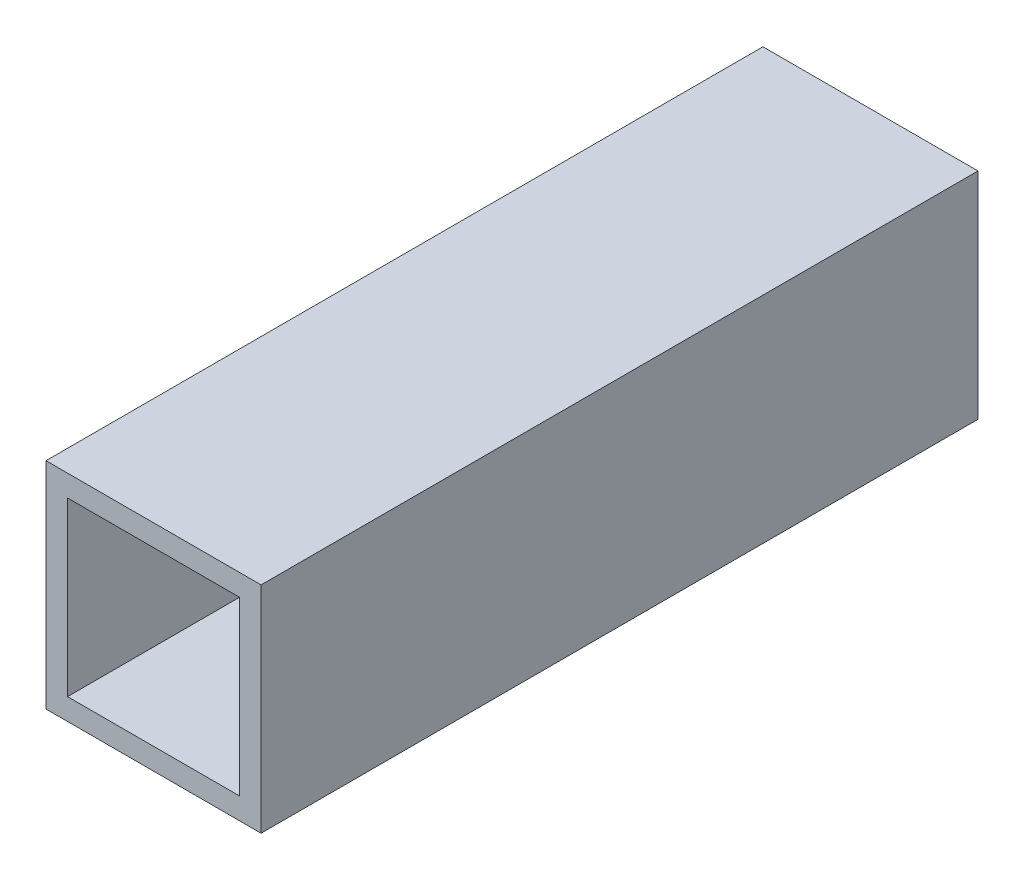
ISO-10303-21;
HEADER;
FILE_DESCRIPTION(('STEP AP214'),'2;1');
FILE_NAME('part.step','',(''),(''),'','','');
FILE_SCHEMA(('AUTOMOTIVE_DESIGN { 1 0 10303 214 1 1 1 1 }'));
ENDSEC;
DATA;
#1=APPLICATION_CONTEXT('core data for automotive mechanical design processes');
#2=APPLICATION_PROTOCOL_DEFINITION('international standard','automotive_design',2000,#1);
#3=PRODUCT_CONTEXT('',#1,'mechanical');
#4=PRODUCT('Part','Part','',(#3));
#5=PRODUCT_RELATED_PRODUCT_CATEGORY('part','',(#4));
#6=PRODUCT_DEFINITION_FORMATION('','',#4);
#7=PRODUCT_DEFINITION_CONTEXT('part definition',#1,'design');
#8=PRODUCT_DEFINITION('design','',#6,#7);
#9=PRODUCT_DEFINITION_SHAPE('','',#8);
#10=(LENGTH_UNIT() NAMED_UNIT(*) SI_UNIT(.MILLI.,.METRE.));
#11=(NAMED_UNIT(*) PLANE_ANGLE_UNIT() SI_UNIT($,.RADIAN.));
#12=(NAMED_UNIT(*) SI_UNIT($,.STERADIAN.) SOLID_ANGLE_UNIT());
#13=UNCERTAINTY_MEASURE_WITH_UNIT(LENGTH_MEASURE(1.E-05),#10,'distance_accuracy_value','');
#14=(GEOMETRIC_REPRESENTATION_CONTEXT(3) GLOBAL_UNCERTAINTY_ASSIGNED_CONTEXT((#13)) GLOBAL_UNIT_ASSIGNED_CONTEXT((#10,
#11,#12)) REPRESENTATION_CONTEXT('',''));
#15=CARTESIAN_POINT('',(0.,0.,0.));
#16=DIRECTION('',(0.,0.,1.));
#17=DIRECTION('',(1.,0.,0.));
#18=AXIS2_PLACEMENT_3D('',#15,#16,#17);
#19=CARTESIAN_POINT('',(0.,0.,50.));
#20=DIRECTION('',(0.,0.,1.));
#21=DIRECTION('',(1.,0.,0.));
#22=AXIS2_PLACEMENT_3D('',#19,#20,#21);
#23=PLANE('',#22);
#24=DIRECTION('',(0.,-1.,0.));
#25=VECTOR('',#24,1.);
#26=CARTESIAN_POINT('',(-7.01008414074451,7.73262608579252,50.));
#27=LINE('',#26,#25);
#28=CARTESIAN_POINT('',(-7.01008414074451,7.73262608579252,50.));
#29=VERTEX_POINT('',#28);
#30=CARTESIAN_POINT('',(-7.01008414074451,-7.26737391420748,50.));
#31=VERTEX_POINT('',#30);
#32=EDGE_CURVE('E134',#29,#31,#27,.T.);
#33=ORIENTED_EDGE('',*,*,#32,.T.);
#34=DIRECTION('',(1.,0.,0.));
#35=VECTOR('',#34,1.);
#36=CARTESIAN_POINT('',(-7.01008414074451,-7.26737391420748,50.));
#37=LINE('',#36,#35);
#38=CARTESIAN_POINT('',(7.98991585925548,-7.26737391420748,50.));
#39=VERTEX_POINT('',#38);
#40=EDGE_CURVE('E137',#31,#39,#37,.T.);
#41=ORIENTED_EDGE('',*,*,#40,.T.);
#42=DIRECTION('',(0.,1.,0.));
#43=VECTOR('',#42,1.);
#44=CARTESIAN_POINT('',(7.98991585925549,7.73262608579252,50.));
#45=LINE('',#44,#43);
#46=CARTESIAN_POINT('',(7.98991585925549,7.73262608579252,50.));
#47=VERTEX_POINT('',#46);
#48=EDGE_CURVE('E140',#39,#47,#45,.T.);
#49=ORIENTED_EDGE('',*,*,#48,.T.);
#50=DIRECTION('',(-1.,0.,0.));
#51=VECTOR('',#50,1.);
#52=CARTESIAN_POINT('',(-7.01008414074451,7.73262608579252,50.));
#53=LINE('',#52,#51);
#54=EDGE_CURVE('E142',#47,#29,#53,.T.);
#55=ORIENTED_EDGE('',*,*,#54,.T.);
#56=EDGE_LOOP('',(#33,#41,#49,#55));
#57=FACE_BOUND('',#56,.T.);
#58=DIRECTION('',(1.,0.,0.));
#59=VECTOR('',#58,1.);
#60=CARTESIAN_POINT('',(-5.51008414074451,-5.76737391420748,50.));
#61=LINE('',#60,#59);
#62=CARTESIAN_POINT('',(-5.51008414074451,-5.76737391420748,50.));
#63=VERTEX_POINT('',#62);
#64=CARTESIAN_POINT('',(6.48991585925549,-5.76737391420748,50.));
#65=VERTEX_POINT('',#64);
#66=EDGE_CURVE('E106',#63,#65,#61,.T.);
#67=ORIENTED_EDGE('',*,*,#66,.F.);
#68=DIRECTION('',(0.,-1.,0.));
#69=VECTOR('',#68,1.);
#70=CARTESIAN_POINT('',(-5.51008414074451,6.23262608579252,50.));
#71=LINE('',#70,#69);
#72=CARTESIAN_POINT('',(-5.51008414074451,6.23262608579252,50.));
#73=VERTEX_POINT('',#72);
#74=EDGE_CURVE('E98',#73,#63,#71,.T.);
#75=ORIENTED_EDGE('',*,*,#74,.F.);
#76=DIRECTION('',(-1.,0.,0.));
#77=VECTOR('',#76,1.);
#78=CARTESIAN_POINT('',(-5.51008414074451,6.23262608579252,50.));
#79=LINE('',#78,#77);
#80=CARTESIAN_POINT('',(6.48991585925549,6.23262608579252,50.));
#81=VERTEX_POINT('',#80);
#82=EDGE_CURVE('E120',#81,#73,#79,.T.);
#83=ORIENTED_EDGE('',*,*,#82,.F.);
#84=DIRECTION('',(0.,1.,0.));
#85=VECTOR('',#84,1.);
#86=CARTESIAN_POINT('',(6.48991585925549,6.23262608579252,50.));
#87=LINE('',#86,#85);
#88=EDGE_CURVE('E118',#65,#81,#87,.T.);
#89=ORIENTED_EDGE('',*,*,#88,.F.);
#90=EDGE_LOOP('',(#67,#75,#83,#89));
#91=FACE_BOUND('',#90,.T.);
#92=ADVANCED_FACE('F33',(#57,#91),#23,.T.);
#93=CARTESIAN_POINT('',(0.,0.,0.));
#94=DIRECTION('',(0.,0.,1.));
#95=DIRECTION('',(1.,0.,0.));
#96=AXIS2_PLACEMENT_3D('',#93,#94,#95);
#97=PLANE('',#96);
#98=DIRECTION('',(0.,-1.,0.));
#99=VECTOR('',#98,1.);
#100=CARTESIAN_POINT('',(-7.01008414074451,7.73262608579252,0.));
#101=LINE('',#100,#99);
#102=CARTESIAN_POINT('',(-7.01008414074451,7.73262608579252,0.));
#103=VERTEX_POINT('',#102);
#104=CARTESIAN_POINT('',(-7.01008414074451,-7.26737391420748,0.));
#105=VERTEX_POINT('',#104);
#106=EDGE_CURVE('E114',#103,#105,#101,.T.);
#107=ORIENTED_EDGE('',*,*,#106,.F.);
#108=DIRECTION('',(-1.,0.,0.));
#109=VECTOR('',#108,1.);
#110=CARTESIAN_POINT('',(-7.01008414074451,7.73262608579252,0.));
#111=LINE('',#110,#109);
#112=CARTESIAN_POINT('',(7.98991585925549,7.73262608579252,0.));
#113=VERTEX_POINT('',#112);
#114=EDGE_CURVE('E138',#113,#103,#111,.T.);
#115=ORIENTED_EDGE('',*,*,#114,.F.);
#116=DIRECTION('',(0.,1.,0.));
#117=VECTOR('',#116,1.);
#118=CARTESIAN_POINT('',(7.98991585925549,7.73262608579252,0.));
#119=LINE('',#118,#117);
#120=CARTESIAN_POINT('',(7.98991585925548,-7.26737391420748,0.));
#121=VERTEX_POINT('',#120);
#122=EDGE_CURVE('E149',#121,#113,#119,.T.);
#123=ORIENTED_EDGE('',*,*,#122,.F.);
#124=DIRECTION('',(1.,0.,0.));
#125=VECTOR('',#124,1.);
#126=CARTESIAN_POINT('',(-7.01008414074451,-7.26737391420748,0.));
#127=LINE('',#126,#125);
#128=EDGE_CURVE('E147',#105,#121,#127,.T.);
#129=ORIENTED_EDGE('',*,*,#128,.F.);
#130=EDGE_LOOP('',(#107,#115,#123,#129));
#131=FACE_BOUND('',#130,.T.);
#132=DIRECTION('',(0.,-1.,0.));
#133=VECTOR('',#132,1.);
#134=CARTESIAN_POINT('',(-5.51008414074451,6.23262608579252,0.));
#135=LINE('',#134,#133);
#136=CARTESIAN_POINT('',(-5.51008414074451,6.23262608579252,0.));
#137=VERTEX_POINT('',#136);
#138=CARTESIAN_POINT('',(-5.51008414074451,-5.76737391420748,0.));
#139=VERTEX_POINT('',#138);
#140=EDGE_CURVE('E56',#137,#139,#135,.T.);
#141=ORIENTED_EDGE('',*,*,#140,.T.);
#142=DIRECTION('',(1.,0.,0.));
#143=VECTOR('',#142,1.);
#144=CARTESIAN_POINT('',(-5.51008414074451,-5.76737391420748,0.));
#145=LINE('',#144,#143);
#146=CARTESIAN_POINT('',(6.48991585925549,-5.76737391420748,0.));
#147=VERTEX_POINT('',#146);
#148=EDGE_CURVE('E113',#139,#147,#145,.T.);
#149=ORIENTED_EDGE('',*,*,#148,.T.);
#150=DIRECTION('',(0.,1.,0.));
#151=VECTOR('',#150,1.);
#152=CARTESIAN_POINT('',(6.48991585925549,6.23262608579252,0.));
#153=LINE('',#152,#151);
#154=CARTESIAN_POINT('',(6.48991585925549,6.23262608579252,0.));
#155=VERTEX_POINT('',#154);
#156=EDGE_CURVE('E126',#147,#155,#153,.T.);
#157=ORIENTED_EDGE('',*,*,#156,.T.);
#158=DIRECTION('',(-1.,0.,0.));
#159=VECTOR('',#158,1.);
#160=CARTESIAN_POINT('',(-5.51008414074451,6.23262608579252,0.));
#161=LINE('',#160,#159);
#162=EDGE_CURVE('E107',#155,#137,#161,.T.);
#163=ORIENTED_EDGE('',*,*,#162,.T.);
#164=EDGE_LOOP('',(#141,#149,#157,#163));
#165=FACE_BOUND('',#164,.T.);
#166=ADVANCED_FACE('F167',(#131,#165),#97,.F.);
#167=CARTESIAN_POINT('',(-7.01008414074451,7.73262608579252,50.));
#168=DIRECTION('',(1.,0.,0.));
#169=DIRECTION('',(0.,1.,0.));
#170=AXIS2_PLACEMENT_3D('',#167,#168,#169);
#171=PLANE('',#170);
#172=ORIENTED_EDGE('',*,*,#106,.T.);
#173=DIRECTION('',(0.,0.,-1.));
#174=VECTOR('',#173,1.);
#175=CARTESIAN_POINT('',(-7.01008414074451,-7.26737391420748,50.));
#176=LINE('',#175,#174);
#177=EDGE_CURVE('E11',#31,#105,#176,.T.);
#178=ORIENTED_EDGE('',*,*,#177,.F.);
#179=ORIENTED_EDGE('',*,*,#32,.F.);
#180=DIRECTION('',(0.,0.,-1.));
#181=VECTOR('',#180,1.);
#182=CARTESIAN_POINT('',(-7.01008414074451,7.73262608579252,50.));
#183=LINE('',#182,#181);
#184=EDGE_CURVE('E144',#29,#103,#183,.T.);
#185=ORIENTED_EDGE('',*,*,#184,.T.);
#186=EDGE_LOOP('',(#172,#178,#179,#185));
#187=FACE_BOUND('',#186,.T.);
#188=ADVANCED_FACE('F35',(#187),#171,.F.);
#189=CARTESIAN_POINT('',(-7.01008414074451,-7.26737391420748,50.));
#190=DIRECTION('',(0.,1.,0.));
#191=DIRECTION('',(0.,0.,1.));
#192=AXIS2_PLACEMENT_3D('',#189,#190,#191);
#193=PLANE('',#192);
#194=ORIENTED_EDGE('',*,*,#128,.T.);
#195=DIRECTION('',(0.,0.,-1.));
#196=VECTOR('',#195,1.);
#197=CARTESIAN_POINT('',(7.98991585925548,-7.26737391420748,50.));
#198=LINE('',#197,#196);
#199=EDGE_CURVE('E41',#39,#121,#198,.T.);
#200=ORIENTED_EDGE('',*,*,#199,.F.);
#201=ORIENTED_EDGE('',*,*,#40,.F.);
#202=ORIENTED_EDGE('',*,*,#177,.T.);
#203=EDGE_LOOP('',(#194,#200,#201,#202));
#204=FACE_BOUND('',#203,.T.);
#205=ADVANCED_FACE('F177',(#204),#193,.F.);
#206=CARTESIAN_POINT('',(7.98991585925549,7.73262608579252,50.));
#207=DIRECTION('',(-1.,0.,0.));
#208=DIRECTION('',(0.,-1.,0.));
#209=AXIS2_PLACEMENT_3D('',#206,#207,#208);
#210=PLANE('',#209);
#211=ORIENTED_EDGE('',*,*,#122,.T.);
#212=DIRECTION('',(0.,0.,-1.));
#213=VECTOR('',#212,1.);
#214=CARTESIAN_POINT('',(7.98991585925549,7.73262608579252,50.));
#215=LINE('',#214,#213);
#216=EDGE_CURVE('E154',#47,#113,#215,.T.);
#217=ORIENTED_EDGE('',*,*,#216,.F.);
#218=ORIENTED_EDGE('',*,*,#48,.F.);
#219=ORIENTED_EDGE('',*,*,#199,.T.);
#220=EDGE_LOOP('',(#211,#217,#218,#219));
#221=FACE_BOUND('',#220,.T.);
#222=ADVANCED_FACE('F161',(#221),#210,.F.);
#223=CARTESIAN_POINT('',(-7.01008414074451,7.73262608579252,50.));
#224=DIRECTION('',(0.,-1.,0.));
#225=DIRECTION('',(0.,0.,-1.));
#226=AXIS2_PLACEMENT_3D('',#223,#224,#225);
#227=PLANE('',#226);
#228=ORIENTED_EDGE('',*,*,#114,.T.);
#229=ORIENTED_EDGE('',*,*,#184,.F.);
#230=ORIENTED_EDGE('',*,*,#54,.F.);
#231=ORIENTED_EDGE('',*,*,#216,.T.);
#232=EDGE_LOOP('',(#228,#229,#230,#231));
#233=FACE_BOUND('',#232,.T.);
#234=ADVANCED_FACE('F171',(#233),#227,.F.);
#235=CARTESIAN_POINT('',(-5.51008414074451,6.23262608579252,50.));
#236=DIRECTION('',(1.,0.,0.));
#237=DIRECTION('',(0.,1.,0.));
#238=AXIS2_PLACEMENT_3D('',#235,#236,#237);
#239=PLANE('',#238);
#240=ORIENTED_EDGE('',*,*,#140,.F.);
#241=DIRECTION('',(0.,0.,-1.));
#242=VECTOR('',#241,1.);
#243=CARTESIAN_POINT('',(-5.51008414074451,6.23262608579252,50.));
#244=LINE('',#243,#242);
#245=EDGE_CURVE('E102',#73,#137,#244,.T.);
#246=ORIENTED_EDGE('',*,*,#245,.F.);
#247=ORIENTED_EDGE('',*,*,#74,.T.);
#248=DIRECTION('',(0.,0.,-1.));
#249=VECTOR('',#248,1.);
#250=CARTESIAN_POINT('',(-5.51008414074451,-5.76737391420748,50.));
#251=LINE('',#250,#249);
#252=EDGE_CURVE('E101',#63,#139,#251,.T.);
#253=ORIENTED_EDGE('',*,*,#252,.T.);
#254=EDGE_LOOP('',(#240,#246,#247,#253));
#255=FACE_BOUND('',#254,.T.);
#256=ADVANCED_FACE('F100',(#255),#239,.T.);
#257=CARTESIAN_POINT('',(-5.51008414074451,-5.76737391420748,50.));
#258=DIRECTION('',(0.,1.,0.));
#259=DIRECTION('',(0.,0.,1.));
#260=AXIS2_PLACEMENT_3D('',#257,#258,#259);
#261=PLANE('',#260);
#262=ORIENTED_EDGE('',*,*,#148,.F.);
#263=ORIENTED_EDGE('',*,*,#252,.F.);
#264=ORIENTED_EDGE('',*,*,#66,.T.);
#265=DIRECTION('',(0.,0.,-1.));
#266=VECTOR('',#265,1.);
#267=CARTESIAN_POINT('',(6.48991585925549,-5.76737391420748,50.));
#268=LINE('',#267,#266);
#269=EDGE_CURVE('E115',#65,#147,#268,.T.);
#270=ORIENTED_EDGE('',*,*,#269,.T.);
#271=EDGE_LOOP('',(#262,#263,#264,#270));
#272=FACE_BOUND('',#271,.T.);
#273=ADVANCED_FACE('F110',(#272),#261,.T.);
#274=CARTESIAN_POINT('',(6.48991585925549,6.23262608579252,50.));
#275=DIRECTION('',(-1.,0.,0.));
#276=DIRECTION('',(0.,-1.,0.));
#277=AXIS2_PLACEMENT_3D('',#274,#275,#276);
#278=PLANE('',#277);
#279=ORIENTED_EDGE('',*,*,#156,.F.);
#280=ORIENTED_EDGE('',*,*,#269,.F.);
#281=ORIENTED_EDGE('',*,*,#88,.T.);
#282=DIRECTION('',(0.,0.,-1.));
#283=VECTOR('',#282,1.);
#284=CARTESIAN_POINT('',(6.48991585925549,6.23262608579252,50.));
#285=LINE('',#284,#283);
#286=EDGE_CURVE('E48',#81,#155,#285,.T.);
#287=ORIENTED_EDGE('',*,*,#286,.T.);
#288=EDGE_LOOP('',(#279,#280,#281,#287));
#289=FACE_BOUND('',#288,.T.);
#290=ADVANCED_FACE('F200',(#289),#278,.T.);
#291=CARTESIAN_POINT('',(-5.51008414074451,6.23262608579252,50.));
#292=DIRECTION('',(0.,-1.,0.));
#293=DIRECTION('',(0.,0.,-1.));
#294=AXIS2_PLACEMENT_3D('',#291,#292,#293);
#295=PLANE('',#294);
#296=ORIENTED_EDGE('',*,*,#162,.F.);
#297=ORIENTED_EDGE('',*,*,#286,.F.);
#298=ORIENTED_EDGE('',*,*,#82,.T.);
#299=ORIENTED_EDGE('',*,*,#245,.T.);
#300=EDGE_LOOP('',(#296,#297,#298,#299));
#301=FACE_BOUND('',#300,.T.);
#302=ADVANCED_FACE('F204',(#301),#295,.T.);
#303=CLOSED_SHELL('',(#92,#166,#188,#205,#222,#234,#256,#273,#290,#302));
#304=MANIFOLD_SOLID_BREP('B2',#303);
#305=ADVANCED_BREP_SHAPE_REPRESENTATION('',(#18,#304),#14);
#306=SHAPE_DEFINITION_REPRESENTATION(#9,#305);
ENDSEC;
END-ISO-10303-21;
